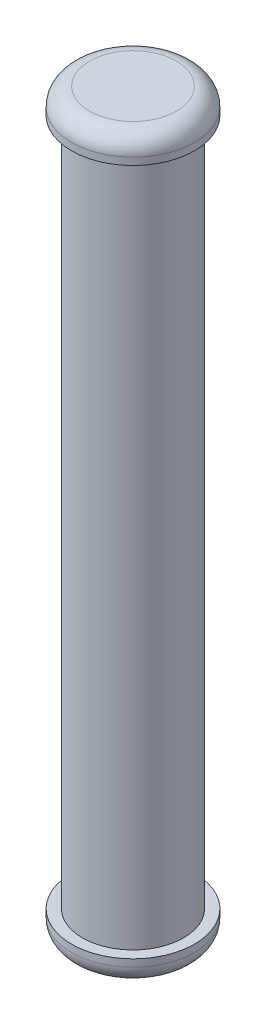
ISO-10303-21;
HEADER;
FILE_DESCRIPTION(('STEP AP214'),'2;1');
FILE_NAME('part.step','',(''),(''),'','','');
FILE_SCHEMA(('AUTOMOTIVE_DESIGN { 1 0 10303 214 1 1 1 1 }'));
ENDSEC;
DATA;
#1=APPLICATION_CONTEXT('core data for automotive mechanical design processes');
#2=APPLICATION_PROTOCOL_DEFINITION('international standard','automotive_design',2000,#1);
#3=PRODUCT_CONTEXT('',#1,'mechanical');
#4=PRODUCT('Part','Part','',(#3));
#5=PRODUCT_RELATED_PRODUCT_CATEGORY('part','',(#4));
#6=PRODUCT_DEFINITION_FORMATION('','',#4);
#7=PRODUCT_DEFINITION_CONTEXT('part definition',#1,'design');
#8=PRODUCT_DEFINITION('design','',#6,#7);
#9=PRODUCT_DEFINITION_SHAPE('','',#8);
#10=(LENGTH_UNIT() NAMED_UNIT(*) SI_UNIT(.MILLI.,.METRE.));
#11=(NAMED_UNIT(*) PLANE_ANGLE_UNIT() SI_UNIT($,.RADIAN.));
#12=(NAMED_UNIT(*) SI_UNIT($,.STERADIAN.) SOLID_ANGLE_UNIT());
#13=UNCERTAINTY_MEASURE_WITH_UNIT(LENGTH_MEASURE(1.E-05),#10,'distance_accuracy_value','');
#14=(GEOMETRIC_REPRESENTATION_CONTEXT(3) GLOBAL_UNCERTAINTY_ASSIGNED_CONTEXT((#13)) GLOBAL_UNIT_ASSIGNED_CONTEXT((#10,
#11,#12)) REPRESENTATION_CONTEXT('',''));
#15=CARTESIAN_POINT('',(0.,0.,0.));
#16=DIRECTION('',(0.,0.,1.));
#17=DIRECTION('',(1.,0.,0.));
#18=AXIS2_PLACEMENT_3D('',#15,#16,#17);
#19=CARTESIAN_POINT('',(0.,19.,0.));
#20=DIRECTION('',(0.,-1.,0.));
#21=DIRECTION('',(0.,0.,-1.));
#22=AXIS2_PLACEMENT_3D('',#19,#20,#21);
#23=CYLINDRICAL_SURFACE('',#22,1.4);
#24=CARTESIAN_POINT('',(0.,19.,0.));
#25=DIRECTION('',(0.,1.,0.));
#26=DIRECTION('',(0.,0.,1.));
#27=AXIS2_PLACEMENT_3D('',#24,#25,#26);
#28=CIRCLE('',#27,1.4);
#29=CARTESIAN_POINT('',(0.,19.,1.4));
#30=VERTEX_POINT('',#29);
#31=EDGE_CURVE('E52',#30,#30,#28,.T.);
#32=ORIENTED_EDGE('',*,*,#31,.F.);
#33=EDGE_LOOP('',(#32));
#34=FACE_BOUND('',#33,.T.);
#35=CARTESIAN_POINT('',(0.,0.,0.));
#36=DIRECTION('',(0.,1.,0.));
#37=DIRECTION('',(0.,0.,1.));
#38=AXIS2_PLACEMENT_3D('',#35,#36,#37);
#39=CIRCLE('',#38,1.4);
#40=CARTESIAN_POINT('',(0.,0.,1.4));
#41=VERTEX_POINT('',#40);
#42=EDGE_CURVE('E53',#41,#41,#39,.T.);
#43=ORIENTED_EDGE('',*,*,#42,.T.);
#44=EDGE_LOOP('',(#43));
#45=FACE_BOUND('',#44,.T.);
#46=ADVANCED_FACE('F32',(#34,#45),#23,.T.);
#47=CARTESIAN_POINT('',(0.,19.7,0.));
#48=DIRECTION('',(0.,-1.,0.));
#49=DIRECTION('',(0.,0.,-1.));
#50=AXIS2_PLACEMENT_3D('',#47,#48,#49);
#51=CYLINDRICAL_SURFACE('',#50,1.7);
#52=CARTESIAN_POINT('',(0.,19.2,0.));
#53=DIRECTION('',(0.,1.,0.));
#54=DIRECTION('',(0.,0.,1.));
#55=AXIS2_PLACEMENT_3D('',#52,#53,#54);
#56=CIRCLE('',#55,1.7);
#57=CARTESIAN_POINT('',(0.,19.2,1.7));
#58=VERTEX_POINT('',#57);
#59=EDGE_CURVE('E43',#58,#58,#56,.F.);
#60=ORIENTED_EDGE('',*,*,#59,.T.);
#61=EDGE_LOOP('',(#60));
#62=FACE_BOUND('',#61,.T.);
#63=CARTESIAN_POINT('',(0.,19.,0.));
#64=DIRECTION('',(0.,1.,0.));
#65=DIRECTION('',(0.,0.,1.));
#66=AXIS2_PLACEMENT_3D('',#63,#64,#65);
#67=CIRCLE('',#66,1.7);
#68=CARTESIAN_POINT('',(0.,19.,1.7));
#69=VERTEX_POINT('',#68);
#70=EDGE_CURVE('E56',#69,#69,#67,.T.);
#71=ORIENTED_EDGE('',*,*,#70,.T.);
#72=EDGE_LOOP('',(#71));
#73=FACE_BOUND('',#72,.T.);
#74=ADVANCED_FACE('F81',(#62,#73),#51,.T.);
#75=CARTESIAN_POINT('',(0.,19.7,0.));
#76=DIRECTION('',(0.,1.,0.));
#77=DIRECTION('',(0.,0.,1.));
#78=AXIS2_PLACEMENT_3D('',#75,#76,#77);
#79=PLANE('',#78);
#80=CARTESIAN_POINT('',(0.,19.7,0.));
#81=DIRECTION('',(0.,1.,0.));
#82=DIRECTION('',(0.,0.,1.));
#83=AXIS2_PLACEMENT_3D('',#80,#81,#82);
#84=CIRCLE('',#83,1.2);
#85=CARTESIAN_POINT('',(0.,19.7,1.2));
#86=VERTEX_POINT('',#85);
#87=EDGE_CURVE('E47',#86,#86,#84,.T.);
#88=ORIENTED_EDGE('',*,*,#87,.T.);
#89=EDGE_LOOP('',(#88));
#90=FACE_BOUND('',#89,.T.);
#91=ADVANCED_FACE('F87',(#90),#79,.T.);
#92=CARTESIAN_POINT('',(0.,19.,0.));
#93=DIRECTION('',(0.,1.,0.));
#94=DIRECTION('',(0.,0.,1.));
#95=AXIS2_PLACEMENT_3D('',#92,#93,#94);
#96=PLANE('',#95);
#97=ORIENTED_EDGE('',*,*,#31,.T.);
#98=EDGE_LOOP('',(#97));
#99=FACE_BOUND('',#98,.T.);
#100=ORIENTED_EDGE('',*,*,#70,.F.);
#101=EDGE_LOOP('',(#100));
#102=FACE_BOUND('',#101,.T.);
#103=ADVANCED_FACE('F95',(#99,#102),#96,.F.);
#104=CARTESIAN_POINT('',(0.,19.2,0.));
#105=DIRECTION('',(0.,1.,0.));
#106=DIRECTION('',(0.,0.,1.));
#107=AXIS2_PLACEMENT_3D('',#104,#105,#106);
#108=TOROIDAL_SURFACE('',#107,1.2,0.5);
#109=ORIENTED_EDGE('',*,*,#59,.F.);
#110=EDGE_LOOP('',(#109));
#111=FACE_BOUND('',#110,.T.);
#112=ORIENTED_EDGE('',*,*,#87,.F.);
#113=EDGE_LOOP('',(#112));
#114=FACE_BOUND('',#113,.T.);
#115=ADVANCED_FACE('F93',(#111,#114),#108,.T.);
#116=CARTESIAN_POINT('',(0.,-0.7,0.));
#117=DIRECTION('',(0.,1.,0.));
#118=DIRECTION('',(0.,0.,1.));
#119=AXIS2_PLACEMENT_3D('',#116,#117,#118);
#120=CYLINDRICAL_SURFACE('',#119,1.7);
#121=CARTESIAN_POINT('',(0.,-0.2,0.));
#122=DIRECTION('',(0.,-1.,0.));
#123=DIRECTION('',(0.,0.,-1.));
#124=AXIS2_PLACEMENT_3D('',#121,#122,#123);
#125=CIRCLE('',#124,1.7);
#126=CARTESIAN_POINT('',(0.,-0.2,-1.7));
#127=VERTEX_POINT('',#126);
#128=EDGE_CURVE('E10',#127,#127,#125,.F.);
#129=ORIENTED_EDGE('',*,*,#128,.T.);
#130=EDGE_LOOP('',(#129));
#131=FACE_BOUND('',#130,.T.);
#132=CARTESIAN_POINT('',(0.,0.,0.));
#133=DIRECTION('',(0.,-1.,0.));
#134=DIRECTION('',(0.,0.,-1.));
#135=AXIS2_PLACEMENT_3D('',#132,#133,#134);
#136=CIRCLE('',#135,1.7);
#137=CARTESIAN_POINT('',(0.,0.,-1.7));
#138=VERTEX_POINT('',#137);
#139=EDGE_CURVE('E57',#138,#138,#136,.T.);
#140=ORIENTED_EDGE('',*,*,#139,.T.);
#141=EDGE_LOOP('',(#140));
#142=FACE_BOUND('',#141,.T.);
#143=ADVANCED_FACE('F65',(#131,#142),#120,.T.);
#144=CARTESIAN_POINT('',(0.,-0.7,0.));
#145=DIRECTION('',(0.,-1.,0.));
#146=DIRECTION('',(0.,0.,-1.));
#147=AXIS2_PLACEMENT_3D('',#144,#145,#146);
#148=PLANE('',#147);
#149=CARTESIAN_POINT('',(0.,-0.7,0.));
#150=DIRECTION('',(0.,-1.,0.));
#151=DIRECTION('',(0.,0.,-1.));
#152=AXIS2_PLACEMENT_3D('',#149,#150,#151);
#153=CIRCLE('',#152,1.2);
#154=CARTESIAN_POINT('',(0.,-0.7,-1.2));
#155=VERTEX_POINT('',#154);
#156=EDGE_CURVE('E39',#155,#155,#153,.T.);
#157=ORIENTED_EDGE('',*,*,#156,.T.);
#158=EDGE_LOOP('',(#157));
#159=FACE_BOUND('',#158,.T.);
#160=ADVANCED_FACE('F69',(#159),#148,.T.);
#161=CARTESIAN_POINT('',(0.,0.,0.));
#162=DIRECTION('',(0.,-1.,0.));
#163=DIRECTION('',(0.,0.,-1.));
#164=AXIS2_PLACEMENT_3D('',#161,#162,#163);
#165=PLANE('',#164);
#166=ORIENTED_EDGE('',*,*,#42,.F.);
#167=EDGE_LOOP('',(#166));
#168=FACE_BOUND('',#167,.T.);
#169=ORIENTED_EDGE('',*,*,#139,.F.);
#170=EDGE_LOOP('',(#169));
#171=FACE_BOUND('',#170,.T.);
#172=ADVANCED_FACE('F67',(#168,#171),#165,.F.);
#173=CARTESIAN_POINT('',(0.,-0.2,0.));
#174=DIRECTION('',(0.,-1.,0.));
#175=DIRECTION('',(0.,0.,-1.));
#176=AXIS2_PLACEMENT_3D('',#173,#174,#175);
#177=TOROIDAL_SURFACE('',#176,1.2,0.5);
#178=ORIENTED_EDGE('',*,*,#128,.F.);
#179=EDGE_LOOP('',(#178));
#180=FACE_BOUND('',#179,.T.);
#181=ORIENTED_EDGE('',*,*,#156,.F.);
#182=EDGE_LOOP('',(#181));
#183=FACE_BOUND('',#182,.T.);
#184=ADVANCED_FACE('F34',(#180,#183),#177,.T.);
#185=CLOSED_SHELL('',(#46,#74,#91,#103,#115,#143,#160,#172,#184));
#186=MANIFOLD_SOLID_BREP('B2',#185);
#187=ADVANCED_BREP_SHAPE_REPRESENTATION('',(#18,#186),#14);
#188=SHAPE_DEFINITION_REPRESENTATION(#9,#187);
ENDSEC;
END-ISO-10303-21;
